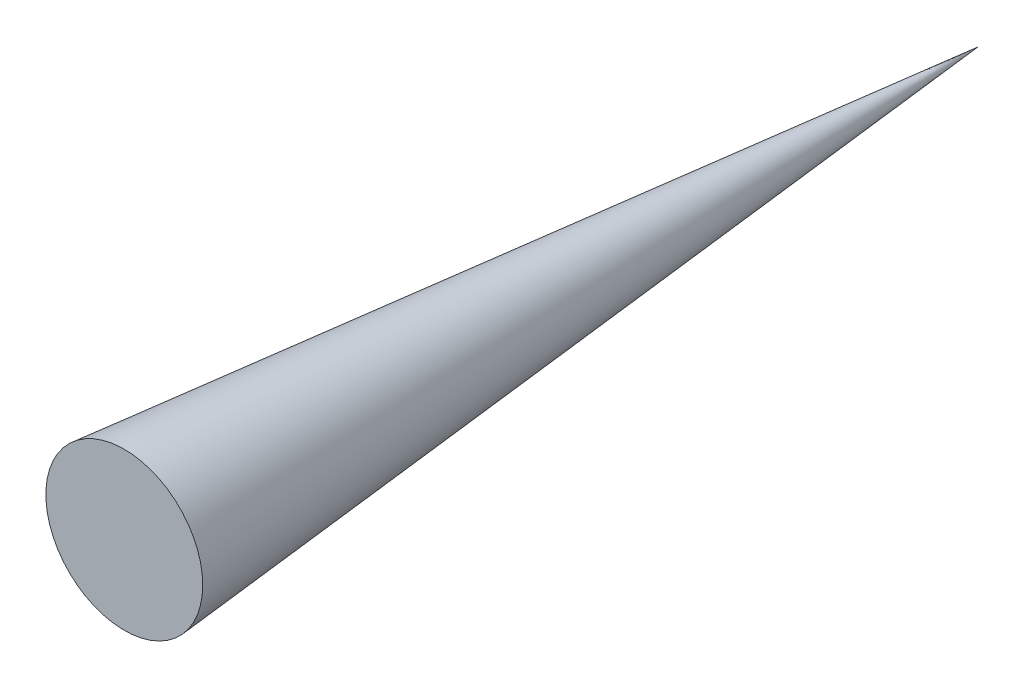
ISO-10303-21;
HEADER;
FILE_DESCRIPTION(('STEP AP214'),'2;1');
FILE_NAME('part.step','',(''),(''),'','','');
FILE_SCHEMA(('AUTOMOTIVE_DESIGN { 1 0 10303 214 1 1 1 1 }'));
ENDSEC;
DATA;
#1=APPLICATION_CONTEXT('core data for automotive mechanical design processes');
#2=APPLICATION_PROTOCOL_DEFINITION('international standard','automotive_design',2000,#1);
#3=PRODUCT_CONTEXT('',#1,'mechanical');
#4=PRODUCT('Part','Part','',(#3));
#5=PRODUCT_RELATED_PRODUCT_CATEGORY('part','',(#4));
#6=PRODUCT_DEFINITION_FORMATION('','',#4);
#7=PRODUCT_DEFINITION_CONTEXT('part definition',#1,'design');
#8=PRODUCT_DEFINITION('design','',#6,#7);
#9=PRODUCT_DEFINITION_SHAPE('','',#8);
#10=(LENGTH_UNIT() NAMED_UNIT(*) SI_UNIT(.MILLI.,.METRE.));
#11=(NAMED_UNIT(*) PLANE_ANGLE_UNIT() SI_UNIT($,.RADIAN.));
#12=(NAMED_UNIT(*) SI_UNIT($,.STERADIAN.) SOLID_ANGLE_UNIT());
#13=UNCERTAINTY_MEASURE_WITH_UNIT(LENGTH_MEASURE(1.E-05),#10,'distance_accuracy_value','');
#14=(GEOMETRIC_REPRESENTATION_CONTEXT(3) GLOBAL_UNCERTAINTY_ASSIGNED_CONTEXT((#13)) GLOBAL_UNIT_ASSIGNED_CONTEXT((#10,
#11,#12)) REPRESENTATION_CONTEXT('',''));
#15=CARTESIAN_POINT('',(0.,0.,0.));
#16=DIRECTION('',(0.,0.,1.));
#17=DIRECTION('',(1.,0.,0.));
#18=AXIS2_PLACEMENT_3D('',#15,#16,#17);
#19=CARTESIAN_POINT('',(0.,0.,-326.5));
#20=DIRECTION('',(0.,0.,1.));
#21=DIRECTION('',(1.,0.,0.));
#22=AXIS2_PLACEMENT_3D('',#19,#20,#21);
#23=CONICAL_SURFACE('',#22,0.,0.0916263372657191);
#24=CARTESIAN_POINT('',(0.,0.,0.));
#25=DIRECTION('',(0.,0.,1.));
#26=DIRECTION('',(1.,0.,0.));
#27=AXIS2_PLACEMENT_3D('',#24,#25,#26);
#28=CIRCLE('',#27,30.);
#29=CARTESIAN_POINT('',(30.,0.,0.));
#30=VERTEX_POINT('',#29);
#31=EDGE_CURVE('E11',#30,#30,#28,.T.);
#32=ORIENTED_EDGE('',*,*,#31,.F.);
#33=EDGE_LOOP('',(#32));
#34=FACE_BOUND('',#33,.T.);
#35=CARTESIAN_POINT('',(0.,0.,-326.5));
#36=VERTEX_POINT('',#35);
#37=VERTEX_LOOP('',#36);
#38=FACE_BOUND('',#37,.T.);
#39=ADVANCED_FACE('F39',(#34,#38),#23,.T.);
#40=CARTESIAN_POINT('',(0.,0.,0.));
#41=DIRECTION('',(0.,0.,-1.));
#42=DIRECTION('',(-1.,0.,0.));
#43=AXIS2_PLACEMENT_3D('',#40,#41,#42);
#44=PLANE('',#43);
#45=ORIENTED_EDGE('',*,*,#31,.T.);
#46=EDGE_LOOP('',(#45));
#47=FACE_BOUND('',#46,.T.);
#48=ADVANCED_FACE('F47',(#47),#44,.F.);
#49=CLOSED_SHELL('',(#39,#48));
#50=MANIFOLD_SOLID_BREP('B2',#49);
#51=ADVANCED_BREP_SHAPE_REPRESENTATION('',(#18,#50),#14);
#52=SHAPE_DEFINITION_REPRESENTATION(#9,#51);
ENDSEC;
END-ISO-10303-21;
